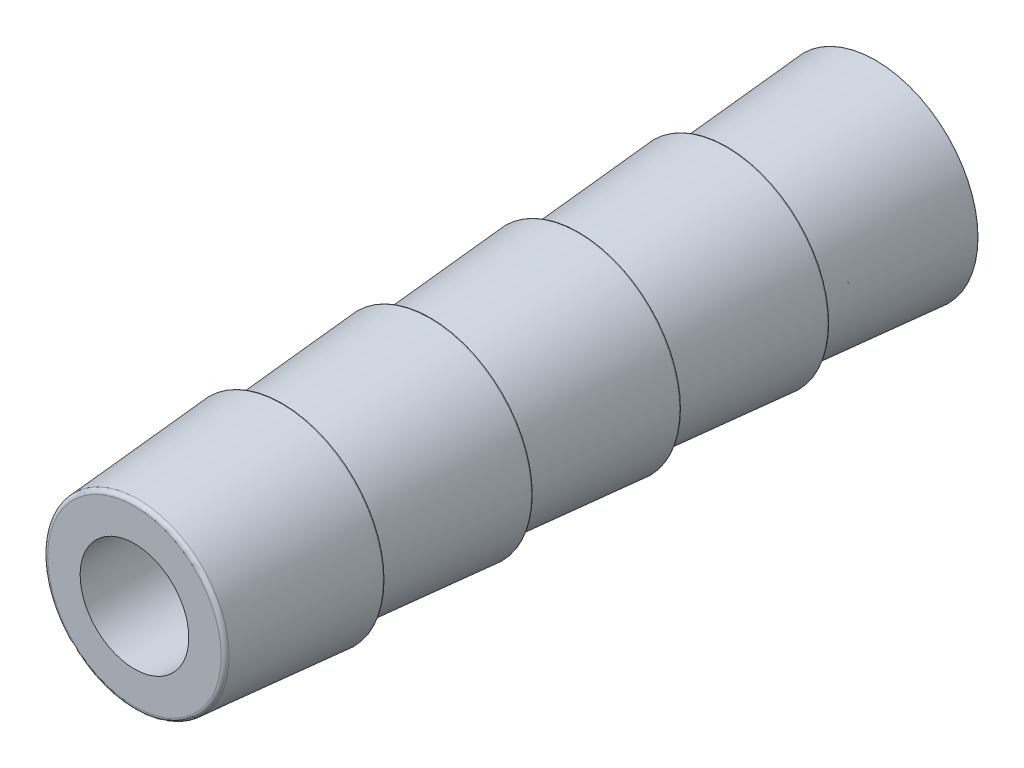
ISO-10303-21;
HEADER;
FILE_DESCRIPTION(('STEP AP214'),'2;1');
FILE_NAME('part.step','',(''),(''),'','','');
FILE_SCHEMA(('AUTOMOTIVE_DESIGN { 1 0 10303 214 1 1 1 1 }'));
ENDSEC;
DATA;
#1=APPLICATION_CONTEXT('core data for automotive mechanical design processes');
#2=APPLICATION_PROTOCOL_DEFINITION('international standard','automotive_design',2000,#1);
#3=PRODUCT_CONTEXT('',#1,'mechanical');
#4=PRODUCT('Part','Part','',(#3));
#5=PRODUCT_RELATED_PRODUCT_CATEGORY('part','',(#4));
#6=PRODUCT_DEFINITION_FORMATION('','',#4);
#7=PRODUCT_DEFINITION_CONTEXT('part definition',#1,'design');
#8=PRODUCT_DEFINITION('design','',#6,#7);
#9=PRODUCT_DEFINITION_SHAPE('','',#8);
#10=(LENGTH_UNIT() NAMED_UNIT(*) SI_UNIT(.MILLI.,.METRE.));
#11=(NAMED_UNIT(*) PLANE_ANGLE_UNIT() SI_UNIT($,.RADIAN.));
#12=(NAMED_UNIT(*) SI_UNIT($,.STERADIAN.) SOLID_ANGLE_UNIT());
#13=UNCERTAINTY_MEASURE_WITH_UNIT(LENGTH_MEASURE(1.E-05),#10,'distance_accuracy_value','');
#14=(GEOMETRIC_REPRESENTATION_CONTEXT(3) GLOBAL_UNCERTAINTY_ASSIGNED_CONTEXT((#13)) GLOBAL_UNIT_ASSIGNED_CONTEXT((#10,
#11,#12)) REPRESENTATION_CONTEXT('',''));
#15=CARTESIAN_POINT('',(0.,0.,0.));
#16=DIRECTION('',(0.,0.,1.));
#17=DIRECTION('',(1.,0.,0.));
#18=AXIS2_PLACEMENT_3D('',#15,#16,#17);
#19=CARTESIAN_POINT('',(-38.4084042323715,-17.8742252188409,33.9358700027938));
#20=DIRECTION('',(0.,0.,1.));
#21=DIRECTION('',(0.,-1.,0.));
#22=AXIS2_PLACEMENT_3D('',#19,#20,#21);
#23=TOROIDAL_SURFACE('',#22,3.12688179386419,0.04445);
#24=CARTESIAN_POINT('',(-38.4084042323715,-17.8742252188409,33.8914200027938));
#25=DIRECTION('',(0.,0.,1.));
#26=DIRECTION('',(0.,-1.,0.));
#27=AXIS2_PLACEMENT_3D('',#24,#25,#26);
#28=CIRCLE('',#27,3.12688179386419);
#29=CARTESIAN_POINT('',(-38.4084042323715,-21.0011070127051,33.8914200027938));
#30=VERTEX_POINT('',#29);
#31=EDGE_CURVE('E70',#30,#30,#28,.F.);
#32=ORIENTED_EDGE('',*,*,#31,.F.);
#33=EDGE_LOOP('',(#32));
#34=FACE_BOUND('',#33,.T.);
#35=CARTESIAN_POINT('',(-38.4084042323715,-17.8742252188409,33.9393873254277));
#36=DIRECTION('',(0.,0.,1.));
#37=DIRECTION('',(0.,-1.,0.));
#38=AXIS2_PLACEMENT_3D('',#35,#36,#37);
#39=CIRCLE('',#38,3.1711924126986);
#40=CARTESIAN_POINT('',(-38.4084042323715,-21.0454176315395,33.9393873254277));
#41=VERTEX_POINT('',#40);
#42=EDGE_CURVE('E88',#41,#41,#39,.T.);
#43=ORIENTED_EDGE('',*,*,#42,.F.);
#44=EDGE_LOOP('',(#43));
#45=FACE_BOUND('',#44,.T.);
#46=ADVANCED_FACE('F41',(#34,#45),#23,.T.);
#47=CARTESIAN_POINT('',(-38.4084042323715,-17.8742252188409,33.8914200027938));
#48=DIRECTION('',(0.,0.,-1.));
#49=DIRECTION('',(0.,1.,0.));
#50=AXIS2_PLACEMENT_3D('',#47,#48,#49);
#51=CONICAL_SURFACE('',#50,3.175,0.0792126806704457);
#52=CARTESIAN_POINT('',(-38.4084042323715,-17.8742252188409,38.4432339301598));
#53=DIRECTION('',(0.,0.,-1.));
#54=DIRECTION('',(0.,1.,0.));
#55=AXIS2_PLACEMENT_3D('',#52,#53,#54);
#56=CIRCLE('',#55,2.8136825873014);
#57=CARTESIAN_POINT('',(-38.4084042323715,-15.0605426315395,38.4432339301598));
#58=VERTEX_POINT('',#57);
#59=EDGE_CURVE('E91',#58,#58,#56,.T.);
#60=ORIENTED_EDGE('',*,*,#59,.T.);
#61=EDGE_LOOP('',(#60));
#62=FACE_BOUND('',#61,.T.);
#63=ORIENTED_EDGE('',*,*,#42,.T.);
#64=EDGE_LOOP('',(#63));
#65=FACE_BOUND('',#64,.T.);
#66=ADVANCED_FACE('F140',(#62,#65),#51,.T.);
#67=CARTESIAN_POINT('',(-38.4084042323715,-17.8742252188409,38.4467512527938));
#68=DIRECTION('',(0.,0.,1.));
#69=DIRECTION('',(0.,-1.,0.));
#70=AXIS2_PLACEMENT_3D('',#67,#68,#69);
#71=TOROIDAL_SURFACE('',#70,2.85799320613581,0.04445);
#72=ORIENTED_EDGE('',*,*,#59,.F.);
#73=EDGE_LOOP('',(#72));
#74=FACE_BOUND('',#73,.T.);
#75=CARTESIAN_POINT('',(-38.4084042323715,-17.8742252188409,38.4912012527938));
#76=DIRECTION('',(0.,0.,1.));
#77=DIRECTION('',(0.,-1.,0.));
#78=AXIS2_PLACEMENT_3D('',#75,#76,#77);
#79=CIRCLE('',#78,2.85799320613581);
#80=CARTESIAN_POINT('',(-38.4084042323715,-20.7322184249767,38.4912012527938));
#81=VERTEX_POINT('',#80);
#82=EDGE_CURVE('E85',#81,#81,#79,.T.);
#83=ORIENTED_EDGE('',*,*,#82,.F.);
#84=EDGE_LOOP('',(#83));
#85=FACE_BOUND('',#84,.T.);
#86=ADVANCED_FACE('F146',(#74,#85),#71,.F.);
#87=CARTESIAN_POINT('',(-38.4084042323715,-14.6992252188409,38.4912012527938));
#88=DIRECTION('',(0.,0.,1.));
#89=DIRECTION('',(0.,-1.,0.));
#90=AXIS2_PLACEMENT_3D('',#87,#88,#89);
#91=PLANE('',#90);
#92=ORIENTED_EDGE('',*,*,#82,.T.);
#93=EDGE_LOOP('',(#92));
#94=FACE_BOUND('',#93,.T.);
#95=CARTESIAN_POINT('',(-38.4084042323715,-17.8742252188409,38.4912012527938));
#96=DIRECTION('',(0.,0.,1.));
#97=DIRECTION('',(0.,-1.,0.));
#98=AXIS2_PLACEMENT_3D('',#95,#96,#97);
#99=CIRCLE('',#98,3.12688179386419);
#100=CARTESIAN_POINT('',(-38.4084042323715,-21.0011070127051,38.4912012527938));
#101=VERTEX_POINT('',#100);
#102=EDGE_CURVE('E82',#101,#101,#99,.F.);
#103=ORIENTED_EDGE('',*,*,#102,.T.);
#104=EDGE_LOOP('',(#103));
#105=FACE_BOUND('',#104,.T.);
#106=ADVANCED_FACE('F169',(#94,#105),#91,.F.);
#107=CARTESIAN_POINT('',(-38.4084042323715,-17.8742252188409,38.5356512527938));
#108=DIRECTION('',(0.,0.,1.));
#109=DIRECTION('',(0.,-1.,0.));
#110=AXIS2_PLACEMENT_3D('',#107,#108,#109);
#111=TOROIDAL_SURFACE('',#110,3.12688179386419,0.04445);
#112=ORIENTED_EDGE('',*,*,#102,.F.);
#113=EDGE_LOOP('',(#112));
#114=FACE_BOUND('',#113,.T.);
#115=CARTESIAN_POINT('',(-38.4084042323715,-17.8742252188409,38.5391685754277));
#116=DIRECTION('',(0.,0.,1.));
#117=DIRECTION('',(0.,-1.,0.));
#118=AXIS2_PLACEMENT_3D('',#115,#116,#117);
#119=CIRCLE('',#118,3.1711924126986);
#120=CARTESIAN_POINT('',(-38.4084042323715,-21.0454176315395,38.5391685754277));
#121=VERTEX_POINT('',#120);
#122=EDGE_CURVE('E100',#121,#121,#119,.T.);
#123=ORIENTED_EDGE('',*,*,#122,.F.);
#124=EDGE_LOOP('',(#123));
#125=FACE_BOUND('',#124,.T.);
#126=ADVANCED_FACE('F153',(#114,#125),#111,.T.);
#127=CARTESIAN_POINT('',(-38.4084042323715,-17.8742252188409,38.4912012527938));
#128=DIRECTION('',(0.,0.,-1.));
#129=DIRECTION('',(0.,1.,0.));
#130=AXIS2_PLACEMENT_3D('',#127,#128,#129);
#131=CONICAL_SURFACE('',#130,3.175,0.0792126806704457);
#132=CARTESIAN_POINT('',(-38.4084042323715,-17.8742252188409,43.0430151801598));
#133=DIRECTION('',(0.,0.,-1.));
#134=DIRECTION('',(0.,1.,0.));
#135=AXIS2_PLACEMENT_3D('',#132,#133,#134);
#136=CIRCLE('',#135,2.8136825873014);
#137=CARTESIAN_POINT('',(-38.4084042323715,-15.0605426315395,43.0430151801598));
#138=VERTEX_POINT('',#137);
#139=EDGE_CURVE('E103',#138,#138,#136,.T.);
#140=ORIENTED_EDGE('',*,*,#139,.T.);
#141=EDGE_LOOP('',(#140));
#142=FACE_BOUND('',#141,.T.);
#143=ORIENTED_EDGE('',*,*,#122,.T.);
#144=EDGE_LOOP('',(#143));
#145=FACE_BOUND('',#144,.T.);
#146=ADVANCED_FACE('F165',(#142,#145),#131,.T.);
#147=CARTESIAN_POINT('',(-38.4084042323715,-17.8742252188409,43.0465325027938));
#148=DIRECTION('',(0.,0.,1.));
#149=DIRECTION('',(0.,-1.,0.));
#150=AXIS2_PLACEMENT_3D('',#147,#148,#149);
#151=TOROIDAL_SURFACE('',#150,2.85799320613581,0.04445);
#152=ORIENTED_EDGE('',*,*,#139,.F.);
#153=EDGE_LOOP('',(#152));
#154=FACE_BOUND('',#153,.T.);
#155=CARTESIAN_POINT('',(-38.4084042323715,-17.8742252188409,43.0909825027938));
#156=DIRECTION('',(0.,0.,1.));
#157=DIRECTION('',(0.,-1.,0.));
#158=AXIS2_PLACEMENT_3D('',#155,#156,#157);
#159=CIRCLE('',#158,2.85799320613581);
#160=CARTESIAN_POINT('',(-38.4084042323715,-20.7322184249767,43.0909825027938));
#161=VERTEX_POINT('',#160);
#162=EDGE_CURVE('E97',#161,#161,#159,.T.);
#163=ORIENTED_EDGE('',*,*,#162,.F.);
#164=EDGE_LOOP('',(#163));
#165=FACE_BOUND('',#164,.T.);
#166=ADVANCED_FACE('F161',(#154,#165),#151,.F.);
#167=CARTESIAN_POINT('',(-38.4084042323715,-14.6992252188409,43.0909825027938));
#168=DIRECTION('',(0.,0.,1.));
#169=DIRECTION('',(0.,-1.,0.));
#170=AXIS2_PLACEMENT_3D('',#167,#168,#169);
#171=PLANE('',#170);
#172=ORIENTED_EDGE('',*,*,#162,.T.);
#173=EDGE_LOOP('',(#172));
#174=FACE_BOUND('',#173,.T.);
#175=CARTESIAN_POINT('',(-38.4084042323715,-17.8742252188409,43.0909825027938));
#176=DIRECTION('',(0.,0.,1.));
#177=DIRECTION('',(0.,-1.,0.));
#178=AXIS2_PLACEMENT_3D('',#175,#176,#177);
#179=CIRCLE('',#178,3.12688179386419);
#180=CARTESIAN_POINT('',(-38.4084042323715,-21.0011070127051,43.0909825027938));
#181=VERTEX_POINT('',#180);
#182=EDGE_CURVE('E94',#181,#181,#179,.F.);
#183=ORIENTED_EDGE('',*,*,#182,.T.);
#184=EDGE_LOOP('',(#183));
#185=FACE_BOUND('',#184,.T.);
#186=ADVANCED_FACE('F164',(#174,#185),#171,.F.);
#187=CARTESIAN_POINT('',(-38.4084042323715,-17.8742252188409,43.1354325027938));
#188=DIRECTION('',(0.,0.,1.));
#189=DIRECTION('',(0.,-1.,0.));
#190=AXIS2_PLACEMENT_3D('',#187,#188,#189);
#191=TOROIDAL_SURFACE('',#190,3.12688179386419,0.04445);
#192=ORIENTED_EDGE('',*,*,#182,.F.);
#193=EDGE_LOOP('',(#192));
#194=FACE_BOUND('',#193,.T.);
#195=CARTESIAN_POINT('',(-38.4084042323715,-17.8742252188409,43.1389498254277));
#196=DIRECTION('',(0.,0.,1.));
#197=DIRECTION('',(0.,-1.,0.));
#198=AXIS2_PLACEMENT_3D('',#195,#196,#197);
#199=CIRCLE('',#198,3.1711924126986);
#200=CARTESIAN_POINT('',(-38.4084042323715,-21.0454176315395,43.1389498254277));
#201=VERTEX_POINT('',#200);
#202=EDGE_CURVE('E106',#201,#201,#199,.T.);
#203=ORIENTED_EDGE('',*,*,#202,.F.);
#204=EDGE_LOOP('',(#203));
#205=FACE_BOUND('',#204,.T.);
#206=ADVANCED_FACE('F186',(#194,#205),#191,.T.);
#207=CARTESIAN_POINT('',(-38.4084042323715,-17.8742252188409,43.0909825027938));
#208=DIRECTION('',(0.,0.,-1.));
#209=DIRECTION('',(0.,1.,0.));
#210=AXIS2_PLACEMENT_3D('',#207,#208,#209);
#211=CONICAL_SURFACE('',#210,3.175,0.0792126806704456);
#212=ORIENTED_EDGE('',*,*,#202,.T.);
#213=EDGE_LOOP('',(#212));
#214=FACE_BOUND('',#213,.T.);
#215=CARTESIAN_POINT('',(-38.4084042323715,-17.8742252188409,47.5738132460337));
#216=DIRECTION('',(0.,0.,1.));
#217=DIRECTION('',(0.,-1.,0.));
#218=AXIS2_PLACEMENT_3D('',#215,#216,#217);
#219=CIRCLE('',#218,2.81915838793954);
#220=CARTESIAN_POINT('',(-38.4084042323715,-20.6933836067804,47.5738132460337));
#221=VERTEX_POINT('',#220);
#222=EDGE_CURVE('E56',#221,#221,#219,.F.);
#223=ORIENTED_EDGE('',*,*,#222,.T.);
#224=EDGE_LOOP('',(#223));
#225=FACE_BOUND('',#224,.T.);
#226=ADVANCED_FACE('F181',(#214,#225),#211,.T.);
#227=CARTESIAN_POINT('',(-38.4084042323715,-17.8742252188409,47.5637637527938));
#228=DIRECTION('',(0.,0.,-1.));
#229=DIRECTION('',(0.,1.,0.));
#230=AXIS2_PLACEMENT_3D('',#227,#228,#229);
#231=TOROIDAL_SURFACE('',#230,2.69255661984122,0.127);
#232=ORIENTED_EDGE('',*,*,#222,.F.);
#233=EDGE_LOOP('',(#232));
#234=FACE_BOUND('',#233,.T.);
#235=CARTESIAN_POINT('',(-38.4084042323715,-17.8742252188409,47.6907637527938));
#236=DIRECTION('',(0.,0.,-1.));
#237=DIRECTION('',(0.,1.,0.));
#238=AXIS2_PLACEMENT_3D('',#235,#236,#237);
#239=CIRCLE('',#238,2.69255661984122);
#240=CARTESIAN_POINT('',(-38.4084042323715,-15.1816685989996,47.6907637527938));
#241=VERTEX_POINT('',#240);
#242=EDGE_CURVE('E52',#241,#241,#239,.F.);
#243=ORIENTED_EDGE('',*,*,#242,.F.);
#244=EDGE_LOOP('',(#243));
#245=FACE_BOUND('',#244,.T.);
#246=ADVANCED_FACE('F136',(#234,#245),#231,.T.);
#247=CARTESIAN_POINT('',(-38.4084042323715,-16.1883002188409,47.6907637527938));
#248=DIRECTION('',(0.,0.,-1.));
#249=DIRECTION('',(0.,1.,0.));
#250=AXIS2_PLACEMENT_3D('',#247,#248,#249);
#251=PLANE('',#250);
#252=ORIENTED_EDGE('',*,*,#242,.T.);
#253=EDGE_LOOP('',(#252));
#254=FACE_BOUND('',#253,.T.);
#255=CARTESIAN_POINT('',(-38.4084042323715,-17.8742252188409,47.6907637527938));
#256=DIRECTION('',(0.,0.,1.));
#257=DIRECTION('',(0.,-1.,0.));
#258=AXIS2_PLACEMENT_3D('',#255,#256,#257);
#259=CIRCLE('',#258,1.685925);
#260=CARTESIAN_POINT('',(-38.4084042323715,-19.5601502188409,47.6907637527938));
#261=VERTEX_POINT('',#260);
#262=EDGE_CURVE('E10',#261,#261,#259,.T.);
#263=ORIENTED_EDGE('',*,*,#262,.F.);
#264=EDGE_LOOP('',(#263));
#265=FACE_BOUND('',#264,.T.);
#266=ADVANCED_FACE('F127',(#254,#265),#251,.F.);
#267=CARTESIAN_POINT('',(-38.4084042323715,-17.8742252188409,32.4110762527938));
#268=DIRECTION('',(0.,0.,1.));
#269=DIRECTION('',(0.,-1.,0.));
#270=AXIS2_PLACEMENT_3D('',#267,#268,#269);
#271=CYLINDRICAL_SURFACE('',#270,1.685925);
#272=CARTESIAN_POINT('',(-38.4084042323715,-17.8742252188409,24.6868248657935));
#273=DIRECTION('',(0.,0.,1.));
#274=DIRECTION('',(1.,0.,0.));
#275=AXIS2_PLACEMENT_3D('',#272,#273,#274);
#276=CIRCLE('',#275,1.685925);
#277=CARTESIAN_POINT('',(-36.7224792323715,-17.8742252188409,24.6868248657935));
#278=VERTEX_POINT('',#277);
#279=EDGE_CURVE('E109',#278,#278,#276,.F.);
#280=ORIENTED_EDGE('',*,*,#279,.T.);
#281=EDGE_LOOP('',(#280));
#282=FACE_BOUND('',#281,.T.);
#283=ORIENTED_EDGE('',*,*,#262,.T.);
#284=EDGE_LOOP('',(#283));
#285=FACE_BOUND('',#284,.T.);
#286=ADVANCED_FACE('F43',(#282,#285),#271,.F.);
#287=CARTESIAN_POINT('',(-38.4084042323715,-14.6992252188409,33.8914200027938));
#288=DIRECTION('',(0.,0.,1.));
#289=DIRECTION('',(0.,-1.,0.));
#290=AXIS2_PLACEMENT_3D('',#287,#288,#289);
#291=PLANE('',#290);
#292=CARTESIAN_POINT('',(-38.4084042323715,-17.8742252188409,33.8914200027938));
#293=DIRECTION('',(0.,0.,1.));
#294=DIRECTION('',(0.,-1.,0.));
#295=AXIS2_PLACEMENT_3D('',#292,#293,#294);
#296=CIRCLE('',#295,2.85799320613581);
#297=CARTESIAN_POINT('',(-38.4084042323715,-20.7322184249767,33.8914200027938));
#298=VERTEX_POINT('',#297);
#299=EDGE_CURVE('E73',#298,#298,#296,.T.);
#300=ORIENTED_EDGE('',*,*,#299,.T.);
#301=EDGE_LOOP('',(#300));
#302=FACE_BOUND('',#301,.T.);
#303=ORIENTED_EDGE('',*,*,#31,.T.);
#304=EDGE_LOOP('',(#303));
#305=FACE_BOUND('',#304,.T.);
#306=ADVANCED_FACE('F126',(#302,#305),#291,.F.);
#307=CARTESIAN_POINT('',(-38.4084042323715,-17.8742252188409,33.8469700027938));
#308=DIRECTION('',(0.,0.,1.));
#309=DIRECTION('',(0.,-1.,0.));
#310=AXIS2_PLACEMENT_3D('',#307,#308,#309);
#311=TOROIDAL_SURFACE('',#310,2.85799320613581,0.04445);
#312=CARTESIAN_POINT('',(-38.4084042323715,-17.8742252188409,33.8434526801598));
#313=DIRECTION('',(0.,0.,-1.));
#314=DIRECTION('',(0.,1.,0.));
#315=AXIS2_PLACEMENT_3D('',#312,#313,#314);
#316=CIRCLE('',#315,2.8136825873014);
#317=CARTESIAN_POINT('',(-38.4084042323715,-15.0605426315395,33.8434526801598));
#318=VERTEX_POINT('',#317);
#319=EDGE_CURVE('E79',#318,#318,#316,.T.);
#320=ORIENTED_EDGE('',*,*,#319,.F.);
#321=EDGE_LOOP('',(#320));
#322=FACE_BOUND('',#321,.T.);
#323=ORIENTED_EDGE('',*,*,#299,.F.);
#324=EDGE_LOOP('',(#323));
#325=FACE_BOUND('',#324,.T.);
#326=ADVANCED_FACE('F132',(#322,#325),#311,.F.);
#327=CARTESIAN_POINT('',(-38.4084042323715,-17.8742252188409,29.2916387527938));
#328=DIRECTION('',(0.,0.,-1.));
#329=DIRECTION('',(0.,1.,0.));
#330=AXIS2_PLACEMENT_3D('',#327,#328,#329);
#331=CONICAL_SURFACE('',#330,3.175,0.0792126806704458);
#332=ORIENTED_EDGE('',*,*,#319,.T.);
#333=EDGE_LOOP('',(#332));
#334=FACE_BOUND('',#333,.T.);
#335=CARTESIAN_POINT('',(-38.4084042323715,-17.8742252188409,29.3396060754277));
#336=DIRECTION('',(0.,0.,1.));
#337=DIRECTION('',(0.,-1.,0.));
#338=AXIS2_PLACEMENT_3D('',#335,#336,#337);
#339=CIRCLE('',#338,3.1711924126986);
#340=CARTESIAN_POINT('',(-38.4084042323715,-21.0454176315395,29.3396060754277));
#341=VERTEX_POINT('',#340);
#342=EDGE_CURVE('E76',#341,#341,#339,.T.);
#343=ORIENTED_EDGE('',*,*,#342,.T.);
#344=EDGE_LOOP('',(#343));
#345=FACE_BOUND('',#344,.T.);
#346=ADVANCED_FACE('F159',(#334,#345),#331,.T.);
#347=CARTESIAN_POINT('',(-38.4084042323715,-17.8742252188409,29.3360887527938));
#348=DIRECTION('',(0.,0.,1.));
#349=DIRECTION('',(0.,-1.,0.));
#350=AXIS2_PLACEMENT_3D('',#347,#348,#349);
#351=TOROIDAL_SURFACE('',#350,3.12688179386419,0.04445);
#352=CARTESIAN_POINT('',(-38.4084042323715,-17.8742252188409,29.2916387527938));
#353=DIRECTION('',(0.,0.,1.));
#354=DIRECTION('',(0.,-1.,0.));
#355=AXIS2_PLACEMENT_3D('',#352,#353,#354);
#356=CIRCLE('',#355,3.12688179386419);
#357=CARTESIAN_POINT('',(-38.4084042323715,-21.0011070127051,29.2916387527938));
#358=VERTEX_POINT('',#357);
#359=EDGE_CURVE('E61',#358,#358,#356,.F.);
#360=ORIENTED_EDGE('',*,*,#359,.F.);
#361=EDGE_LOOP('',(#360));
#362=FACE_BOUND('',#361,.T.);
#363=ORIENTED_EDGE('',*,*,#342,.F.);
#364=EDGE_LOOP('',(#363));
#365=FACE_BOUND('',#364,.T.);
#366=ADVANCED_FACE('F155',(#362,#365),#351,.T.);
#367=CARTESIAN_POINT('',(-38.4084042323715,-14.6992252188409,29.2916387527938));
#368=DIRECTION('',(0.,0.,1.));
#369=DIRECTION('',(0.,-1.,0.));
#370=AXIS2_PLACEMENT_3D('',#367,#368,#369);
#371=PLANE('',#370);
#372=CARTESIAN_POINT('',(-38.4084042323715,-17.8742252188409,29.2916387527938));
#373=DIRECTION('',(0.,0.,1.));
#374=DIRECTION('',(0.,-1.,0.));
#375=AXIS2_PLACEMENT_3D('',#372,#373,#374);
#376=CIRCLE('',#375,2.85799320613581);
#377=CARTESIAN_POINT('',(-38.4084042323715,-20.7322184249767,29.2916387527938));
#378=VERTEX_POINT('',#377);
#379=EDGE_CURVE('E64',#378,#378,#376,.T.);
#380=ORIENTED_EDGE('',*,*,#379,.T.);
#381=EDGE_LOOP('',(#380));
#382=FACE_BOUND('',#381,.T.);
#383=ORIENTED_EDGE('',*,*,#359,.T.);
#384=EDGE_LOOP('',(#383));
#385=FACE_BOUND('',#384,.T.);
#386=ADVANCED_FACE('F158',(#382,#385),#371,.F.);
#387=CARTESIAN_POINT('',(-38.4084042323715,-17.8742252188409,29.2471887527938));
#388=DIRECTION('',(0.,0.,1.));
#389=DIRECTION('',(0.,-1.,0.));
#390=AXIS2_PLACEMENT_3D('',#387,#388,#389);
#391=TOROIDAL_SURFACE('',#390,2.85799320613581,0.04445);
#392=CARTESIAN_POINT('',(-38.4084042323715,-17.8742252188409,29.2436714301598));
#393=DIRECTION('',(0.,0.,-1.));
#394=DIRECTION('',(0.,1.,0.));
#395=AXIS2_PLACEMENT_3D('',#392,#393,#394);
#396=CIRCLE('',#395,2.8136825873014);
#397=CARTESIAN_POINT('',(-38.4084042323715,-15.0605426315395,29.2436714301598));
#398=VERTEX_POINT('',#397);
#399=EDGE_CURVE('E67',#398,#398,#396,.T.);
#400=ORIENTED_EDGE('',*,*,#399,.F.);
#401=EDGE_LOOP('',(#400));
#402=FACE_BOUND('',#401,.T.);
#403=ORIENTED_EDGE('',*,*,#379,.F.);
#404=EDGE_LOOP('',(#403));
#405=FACE_BOUND('',#404,.T.);
#406=ADVANCED_FACE('F174',(#402,#405),#391,.F.);
#407=CARTESIAN_POINT('',(-38.4084042323715,-17.8742252188409,24.6918575027938));
#408=DIRECTION('',(0.,0.,-1.));
#409=DIRECTION('',(0.,1.,0.));
#410=AXIS2_PLACEMENT_3D('',#407,#408,#409);
#411=CONICAL_SURFACE('',#410,3.175,0.0792126806704457);
#412=ORIENTED_EDGE('',*,*,#399,.T.);
#413=EDGE_LOOP('',(#412));
#414=FACE_BOUND('',#413,.T.);
#415=CARTESIAN_POINT('',(-38.4084042323715,-17.8742252188409,24.6968743590334));
#416=DIRECTION('',(0.,0.,1.));
#417=DIRECTION('',(0.,-1.,0.));
#418=AXIS2_PLACEMENT_3D('',#415,#416,#417);
#419=CIRCLE('',#418,3.17460176809832);
#420=CARTESIAN_POINT('',(-38.4084042323715,-21.0488269869392,24.6968743590334));
#421=VERTEX_POINT('',#420);
#422=EDGE_CURVE('E48',#421,#421,#419,.T.);
#423=ORIENTED_EDGE('',*,*,#422,.T.);
#424=EDGE_LOOP('',(#423));
#425=FACE_BOUND('',#424,.T.);
#426=ADVANCED_FACE('F177',(#414,#425),#411,.T.);
#427=CARTESIAN_POINT('',(-38.4084042323715,-17.8742252188409,24.6868248657935));
#428=DIRECTION('',(0.,0.,-1.));
#429=DIRECTION('',(0.,1.,0.));
#430=AXIS2_PLACEMENT_3D('',#427,#428,#429);
#431=TOROIDAL_SURFACE('',#430,3.048,0.127);
#432=CARTESIAN_POINT('',(-38.4084042323715,-17.8742252188409,24.6868248657935));
#433=DIRECTION('',(0.,0.,1.));
#434=DIRECTION('',(1.,0.,0.));
#435=AXIS2_PLACEMENT_3D('',#432,#433,#434);
#436=CIRCLE('',#435,3.175);
#437=CARTESIAN_POINT('',(-35.2334042323715,-17.8742252188409,24.6868248657935));
#438=VERTEX_POINT('',#437);
#439=EDGE_CURVE('E112',#438,#438,#436,.T.);
#440=ORIENTED_EDGE('',*,*,#439,.T.);
#441=EDGE_LOOP('',(#440));
#442=FACE_BOUND('',#441,.T.);
#443=ORIENTED_EDGE('',*,*,#422,.F.);
#444=EDGE_LOOP('',(#443));
#445=FACE_BOUND('',#444,.T.);
#446=ADVANCED_FACE('F116',(#442,#445),#431,.T.);
#447=CARTESIAN_POINT('',(-50.189387772472,-45.466,24.6868248657935));
#448=DIRECTION('',(0.,0.,1.));
#449=DIRECTION('',(1.,0.,0.));
#450=AXIS2_PLACEMENT_3D('',#447,#448,#449);
#451=PLANE('',#450);
#452=ORIENTED_EDGE('',*,*,#439,.F.);
#453=EDGE_LOOP('',(#452));
#454=FACE_BOUND('',#453,.T.);
#455=ORIENTED_EDGE('',*,*,#279,.F.);
#456=EDGE_LOOP('',(#455));
#457=FACE_BOUND('',#456,.T.);
#458=ADVANCED_FACE('F119',(#454,#457),#451,.F.);
#459=CLOSED_SHELL('',(#46,#66,#86,#106,#126,#146,#166,#186,#206,#226,#246,#266,#286,#306,#326,
#346,#366,#386,#406,#426,#446,#458));
#460=MANIFOLD_SOLID_BREP('B2',#459);
#461=ADVANCED_BREP_SHAPE_REPRESENTATION('',(#18,#460),#14);
#462=SHAPE_DEFINITION_REPRESENTATION(#9,#461);
ENDSEC;
END-ISO-10303-21;
